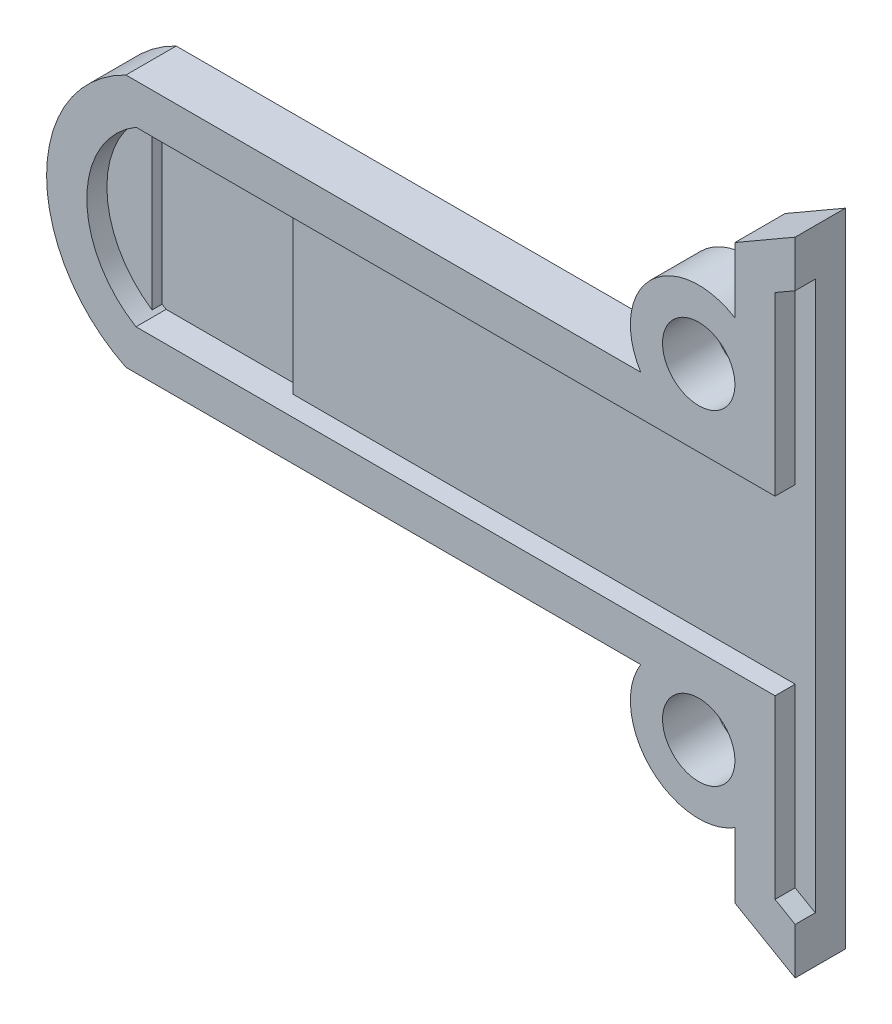
ISO-10303-21;
HEADER;
FILE_DESCRIPTION(('STEP AP214'),'2;1');
FILE_NAME('part.step','',(''),(''),'','','');
FILE_SCHEMA(('AUTOMOTIVE_DESIGN { 1 0 10303 214 1 1 1 1 }'));
ENDSEC;
DATA;
#1=APPLICATION_CONTEXT('core data for automotive mechanical design processes');
#2=APPLICATION_PROTOCOL_DEFINITION('international standard','automotive_design',2000,#1);
#3=PRODUCT_CONTEXT('',#1,'mechanical');
#4=PRODUCT('Part','Part','',(#3));
#5=PRODUCT_RELATED_PRODUCT_CATEGORY('part','',(#4));
#6=PRODUCT_DEFINITION_FORMATION('','',#4);
#7=PRODUCT_DEFINITION_CONTEXT('part definition',#1,'design');
#8=PRODUCT_DEFINITION('design','',#6,#7);
#9=PRODUCT_DEFINITION_SHAPE('','',#8);
#10=(LENGTH_UNIT() NAMED_UNIT(*) SI_UNIT(.MILLI.,.METRE.));
#11=(NAMED_UNIT(*) PLANE_ANGLE_UNIT() SI_UNIT($,.RADIAN.));
#12=(NAMED_UNIT(*) SI_UNIT($,.STERADIAN.) SOLID_ANGLE_UNIT());
#13=UNCERTAINTY_MEASURE_WITH_UNIT(LENGTH_MEASURE(1.E-05),#10,'distance_accuracy_value','');
#14=(GEOMETRIC_REPRESENTATION_CONTEXT(3) GLOBAL_UNCERTAINTY_ASSIGNED_CONTEXT((#13)) GLOBAL_UNIT_ASSIGNED_CONTEXT((#10,
#11,#12)) REPRESENTATION_CONTEXT('',''));
#15=CARTESIAN_POINT('',(0.,0.,0.));
#16=DIRECTION('',(0.,0.,1.));
#17=DIRECTION('',(1.,0.,0.));
#18=AXIS2_PLACEMENT_3D('',#15,#16,#17);
#19=CARTESIAN_POINT('',(30.25,31.4,-8.));
#20=DIRECTION('',(-1.,0.,0.));
#21=DIRECTION('',(0.,0.,1.));
#22=AXIS2_PLACEMENT_3D('',#19,#20,#21);
#23=PLANE('',#22);
#24=DIRECTION('',(0.,1.,0.));
#25=VECTOR('',#24,1.);
#26=CARTESIAN_POINT('',(30.25,0.,16.5));
#27=LINE('',#26,#25);
#28=CARTESIAN_POINT('',(30.25,-15.9637349430953,16.5));
#29=VERTEX_POINT('',#28);
#30=CARTESIAN_POINT('',(30.25,15.9637349430924,16.5));
#31=VERTEX_POINT('',#30);
#32=EDGE_CURVE('E11',#29,#31,#27,.T.);
#33=ORIENTED_EDGE('',*,*,#32,.T.);
#34=DIRECTION('',(0.,0.,-1.));
#35=VECTOR('',#34,1.);
#36=CARTESIAN_POINT('',(30.25,15.9637349430924,16.5));
#37=LINE('',#36,#35);
#38=CARTESIAN_POINT('',(30.25,15.9637349430924,19.));
#39=VERTEX_POINT('',#38);
#40=EDGE_CURVE('E364',#39,#31,#37,.T.);
#41=ORIENTED_EDGE('',*,*,#40,.F.);
#42=DIRECTION('',(0.,1.,0.));
#43=VECTOR('',#42,1.);
#44=CARTESIAN_POINT('',(30.25,0.,19.));
#45=LINE('',#44,#43);
#46=CARTESIAN_POINT('',(30.25,13.6543338663339,19.));
#47=VERTEX_POINT('',#46);
#48=EDGE_CURVE('E363',#47,#39,#45,.T.);
#49=ORIENTED_EDGE('',*,*,#48,.F.);
#50=DIRECTION('',(0.,0.,-1.));
#51=VECTOR('',#50,1.);
#52=CARTESIAN_POINT('',(30.25,13.6543338663339,16.5));
#53=LINE('',#52,#51);
#54=CARTESIAN_POINT('',(30.25,13.6543338663339,18.));
#55=VERTEX_POINT('',#54);
#56=EDGE_CURVE('E55',#47,#55,#53,.T.);
#57=ORIENTED_EDGE('',*,*,#56,.T.);
#58=DIRECTION('',(0.,1.,0.));
#59=VECTOR('',#58,1.);
#60=CARTESIAN_POINT('',(30.25,0.,18.));
#61=LINE('',#60,#59);
#62=CARTESIAN_POINT('',(30.25,-13.6543338663368,18.));
#63=VERTEX_POINT('',#62);
#64=EDGE_CURVE('E205',#63,#55,#61,.T.);
#65=ORIENTED_EDGE('',*,*,#64,.F.);
#66=DIRECTION('',(0.,0.,1.));
#67=VECTOR('',#66,1.);
#68=CARTESIAN_POINT('',(30.25,-13.6543338663368,16.5));
#69=LINE('',#68,#67);
#70=CARTESIAN_POINT('',(30.25,-13.6543338663368,19.));
#71=VERTEX_POINT('',#70);
#72=EDGE_CURVE('E40',#63,#71,#69,.T.);
#73=ORIENTED_EDGE('',*,*,#72,.T.);
#74=CARTESIAN_POINT('',(30.25,-15.9637349430953,19.));
#75=VERTEX_POINT('',#74);
#76=EDGE_CURVE('E47',#75,#71,#45,.T.);
#77=ORIENTED_EDGE('',*,*,#76,.F.);
#78=DIRECTION('',(0.,0.,1.));
#79=VECTOR('',#78,1.);
#80=CARTESIAN_POINT('',(30.25,-15.9637349430953,16.5));
#81=LINE('',#80,#79);
#82=EDGE_CURVE('E359',#29,#75,#81,.T.);
#83=ORIENTED_EDGE('',*,*,#82,.F.);
#84=EDGE_LOOP('',(#33,#41,#49,#57,#65,#73,#77,#83));
#85=FACE_BOUND('',#84,.T.);
#86=ADVANCED_FACE('F33',(#85),#23,.F.);
#87=CARTESIAN_POINT('',(0.,0.,18.));
#88=DIRECTION('',(0.,0.,-1.));
#89=DIRECTION('',(-1.,0.,0.));
#90=AXIS2_PLACEMENT_3D('',#87,#88,#89);
#91=PLANE('',#90);
#92=CARTESIAN_POINT('',(0.,0.,18.));
#93=DIRECTION('',(0.,0.,-1.));
#94=DIRECTION('',(-1.,0.,0.));
#95=AXIS2_PLACEMENT_3D('',#92,#93,#94);
#96=CIRCLE('',#95,5.);
#97=CARTESIAN_POINT('',(-2.75,-4.17582327212252,18.));
#98=VERTEX_POINT('',#97);
#99=CARTESIAN_POINT('',(-2.75,4.17582327212252,18.));
#100=VERTEX_POINT('',#99);
#101=EDGE_CURVE('E266',#98,#100,#96,.T.);
#102=ORIENTED_EDGE('',*,*,#101,.F.);
#103=DIRECTION('',(0.,1.,0.));
#104=VECTOR('',#103,1.);
#105=CARTESIAN_POINT('',(-2.75,-4.30000000000001,18.));
#106=LINE('',#105,#104);
#107=EDGE_CURVE('E248',#98,#100,#106,.T.);
#108=ORIENTED_EDGE('',*,*,#107,.T.);
#109=EDGE_LOOP('',(#102,#108));
#110=FACE_BOUND('',#109,.T.);
#111=ADVANCED_FACE('F400',(#110),#91,.F.);
#112=CARTESIAN_POINT('',(-2.75,-4.30000000000001,18.));
#113=DIRECTION('',(-1.,0.,0.));
#114=DIRECTION('',(0.,0.,1.));
#115=AXIS2_PLACEMENT_3D('',#112,#113,#114);
#116=PLANE('',#115);
#117=DIRECTION('',(0.,-1.,0.));
#118=VECTOR('',#117,1.);
#119=CARTESIAN_POINT('',(-2.75,-4.30000000000001,17.5));
#120=LINE('',#119,#118);
#121=CARTESIAN_POINT('',(-2.75,4.17582327212252,17.5));
#122=VERTEX_POINT('',#121);
#123=CARTESIAN_POINT('',(-2.75,-4.17582327212252,17.5));
#124=VERTEX_POINT('',#123);
#125=EDGE_CURVE('E347',#122,#124,#120,.T.);
#126=ORIENTED_EDGE('',*,*,#125,.F.);
#127=DIRECTION('',(0.,0.,1.));
#128=VECTOR('',#127,1.);
#129=CARTESIAN_POINT('',(-2.75,4.17582327212252,16.5));
#130=LINE('',#129,#128);
#131=EDGE_CURVE('E342',#100,#122,#130,.F.);
#132=ORIENTED_EDGE('',*,*,#131,.F.);
#133=ORIENTED_EDGE('',*,*,#107,.F.);
#134=DIRECTION('',(0.,0.,1.));
#135=VECTOR('',#134,1.);
#136=CARTESIAN_POINT('',(-2.75,-4.17582327212252,16.5));
#137=LINE('',#136,#135);
#138=EDGE_CURVE('E345',#124,#98,#137,.T.);
#139=ORIENTED_EDGE('',*,*,#138,.F.);
#140=EDGE_LOOP('',(#126,#132,#133,#139));
#141=FACE_BOUND('',#140,.T.);
#142=ADVANCED_FACE('F405',(#141),#116,.F.);
#143=CARTESIAN_POINT('',(0.,0.,17.5));
#144=DIRECTION('',(0.,0.,-1.));
#145=DIRECTION('',(-1.,0.,0.));
#146=AXIS2_PLACEMENT_3D('',#143,#144,#145);
#147=PLANE('',#146);
#148=DIRECTION('',(-1.,0.,0.));
#149=VECTOR('',#148,1.);
#150=CARTESIAN_POINT('',(-2.55147016443463,-4.29999999999999,17.5));
#151=LINE('',#150,#149);
#152=CARTESIAN_POINT('',(4.25,-4.30000000000001,17.5));
#153=VERTEX_POINT('',#152);
#154=CARTESIAN_POINT('',(-2.55147016443462,-4.29999999999999,17.5));
#155=VERTEX_POINT('',#154);
#156=EDGE_CURVE('E240',#153,#155,#151,.T.);
#157=ORIENTED_EDGE('',*,*,#156,.F.);
#158=DIRECTION('',(0.,1.,0.));
#159=VECTOR('',#158,1.);
#160=CARTESIAN_POINT('',(4.25,-4.30000000000001,17.5));
#161=LINE('',#160,#159);
#162=CARTESIAN_POINT('',(4.25,4.30000000000001,17.5));
#163=VERTEX_POINT('',#162);
#164=EDGE_CURVE('E244',#153,#163,#161,.T.);
#165=ORIENTED_EDGE('',*,*,#164,.T.);
#166=DIRECTION('',(1.,0.,0.));
#167=VECTOR('',#166,1.);
#168=CARTESIAN_POINT('',(29.25,4.30000000000001,17.5));
#169=LINE('',#168,#167);
#170=CARTESIAN_POINT('',(-2.5514701644346,4.30000000000001,17.5));
#171=VERTEX_POINT('',#170);
#172=EDGE_CURVE('E242',#171,#163,#169,.T.);
#173=ORIENTED_EDGE('',*,*,#172,.F.);
#174=CARTESIAN_POINT('',(0.,0.,17.5));
#175=DIRECTION('',(0.,0.,-1.));
#176=DIRECTION('',(-1.,0.,0.));
#177=AXIS2_PLACEMENT_3D('',#174,#175,#176);
#178=CIRCLE('',#177,5.);
#179=EDGE_CURVE('E239',#122,#171,#178,.T.);
#180=ORIENTED_EDGE('',*,*,#179,.F.);
#181=ORIENTED_EDGE('',*,*,#125,.T.);
#182=EDGE_CURVE('E236',#155,#124,#178,.T.);
#183=ORIENTED_EDGE('',*,*,#182,.F.);
#184=EDGE_LOOP('',(#157,#165,#173,#180,#181,#183));
#185=FACE_BOUND('',#184,.T.);
#186=ADVANCED_FACE('F431',(#185),#147,.F.);
#187=CARTESIAN_POINT('',(0.,0.,16.5));
#188=DIRECTION('',(0.,0.,1.));
#189=DIRECTION('',(1.,0.,0.));
#190=AXIS2_PLACEMENT_3D('',#187,#188,#189);
#191=CYLINDRICAL_SURFACE('',#190,5.);
#192=ORIENTED_EDGE('',*,*,#131,.T.);
#193=ORIENTED_EDGE('',*,*,#179,.T.);
#194=DIRECTION('',(0.,0.,1.));
#195=VECTOR('',#194,1.);
#196=CARTESIAN_POINT('',(-2.5514701644346,4.30000000000001,16.5));
#197=LINE('',#196,#195);
#198=CARTESIAN_POINT('',(-2.5514701644346,4.30000000000001,19.));
#199=VERTEX_POINT('',#198);
#200=EDGE_CURVE('E291',#171,#199,#197,.T.);
#201=ORIENTED_EDGE('',*,*,#200,.T.);
#202=CARTESIAN_POINT('',(0.,0.,19.));
#203=DIRECTION('',(0.,0.,-1.));
#204=DIRECTION('',(-1.,0.,0.));
#205=AXIS2_PLACEMENT_3D('',#202,#203,#204);
#206=CIRCLE('',#205,5.);
#207=CARTESIAN_POINT('',(-2.55147016443462,-4.29999999999999,19.));
#208=VERTEX_POINT('',#207);
#209=EDGE_CURVE('E283',#208,#199,#206,.T.);
#210=ORIENTED_EDGE('',*,*,#209,.F.);
#211=DIRECTION('',(0.,0.,1.));
#212=VECTOR('',#211,1.);
#213=CARTESIAN_POINT('',(-2.55147016443462,-4.29999999999999,16.5));
#214=LINE('',#213,#212);
#215=EDGE_CURVE('E293',#155,#208,#214,.T.);
#216=ORIENTED_EDGE('',*,*,#215,.F.);
#217=ORIENTED_EDGE('',*,*,#182,.T.);
#218=ORIENTED_EDGE('',*,*,#138,.T.);
#219=ORIENTED_EDGE('',*,*,#101,.T.);
#220=EDGE_LOOP('',(#192,#193,#201,#210,#216,#217,#218,#219));
#221=FACE_BOUND('',#220,.T.);
#222=ADVANCED_FACE('F427',(#221),#191,.F.);
#223=CARTESIAN_POINT('',(25.45,-8.09999999999999,28.616652224137));
#224=DIRECTION('',(0.,0.,-1.));
#225=DIRECTION('',(-1.,0.,0.));
#226=AXIS2_PLACEMENT_3D('',#223,#224,#225);
#227=CYLINDRICAL_SURFACE('',#226,1.8);
#228=CARTESIAN_POINT('',(25.45,-8.09999999999999,16.5));
#229=DIRECTION('',(0.,0.,-1.));
#230=DIRECTION('',(-1.,0.,0.));
#231=AXIS2_PLACEMENT_3D('',#228,#229,#230);
#232=CIRCLE('',#231,1.8);
#233=CARTESIAN_POINT('',(23.65,-8.09999999999999,16.5));
#234=VERTEX_POINT('',#233);
#235=EDGE_CURVE('E216',#234,#234,#232,.T.);
#236=ORIENTED_EDGE('',*,*,#235,.T.);
#237=EDGE_LOOP('',(#236));
#238=FACE_BOUND('',#237,.T.);
#239=CARTESIAN_POINT('',(25.45,-8.09999999999999,19.));
#240=DIRECTION('',(0.,0.,-1.));
#241=DIRECTION('',(-1.,0.,0.));
#242=AXIS2_PLACEMENT_3D('',#239,#240,#241);
#243=CIRCLE('',#242,1.8);
#244=CARTESIAN_POINT('',(23.65,-8.09999999999999,19.));
#245=VERTEX_POINT('',#244);
#246=EDGE_CURVE('E211',#245,#245,#243,.F.);
#247=ORIENTED_EDGE('',*,*,#246,.T.);
#248=EDGE_LOOP('',(#247));
#249=FACE_BOUND('',#248,.T.);
#250=ADVANCED_FACE('F430',(#238,#249),#227,.F.);
#251=CARTESIAN_POINT('',(25.45,8.10000000000001,28.616652224137));
#252=DIRECTION('',(0.,0.,-1.));
#253=DIRECTION('',(-1.,0.,0.));
#254=AXIS2_PLACEMENT_3D('',#251,#252,#253);
#255=CYLINDRICAL_SURFACE('',#254,1.8);
#256=CARTESIAN_POINT('',(25.45,8.10000000000001,16.5));
#257=DIRECTION('',(0.,0.,-1.));
#258=DIRECTION('',(-1.,0.,0.));
#259=AXIS2_PLACEMENT_3D('',#256,#257,#258);
#260=CIRCLE('',#259,1.8);
#261=CARTESIAN_POINT('',(23.65,8.10000000000001,16.5));
#262=VERTEX_POINT('',#261);
#263=EDGE_CURVE('E222',#262,#262,#260,.T.);
#264=ORIENTED_EDGE('',*,*,#263,.T.);
#265=EDGE_LOOP('',(#264));
#266=FACE_BOUND('',#265,.T.);
#267=CARTESIAN_POINT('',(25.45,8.10000000000001,19.));
#268=DIRECTION('',(0.,0.,-1.));
#269=DIRECTION('',(-1.,0.,0.));
#270=AXIS2_PLACEMENT_3D('',#267,#268,#269);
#271=CIRCLE('',#270,1.8);
#272=CARTESIAN_POINT('',(23.65,8.10000000000001,19.));
#273=VERTEX_POINT('',#272);
#274=EDGE_CURVE('E226',#273,#273,#271,.F.);
#275=ORIENTED_EDGE('',*,*,#274,.T.);
#276=EDGE_LOOP('',(#275));
#277=FACE_BOUND('',#276,.T.);
#278=ADVANCED_FACE('F469',(#266,#277),#255,.F.);
#279=CARTESIAN_POINT('',(25.45,8.10000000000001,28.616652224137));
#280=DIRECTION('',(0.,0.,-1.));
#281=DIRECTION('',(-1.,0.,0.));
#282=AXIS2_PLACEMENT_3D('',#279,#280,#281);
#283=CYLINDRICAL_SURFACE('',#282,3.4);
#284=DIRECTION('',(0.,0.,-1.));
#285=VECTOR('',#284,1.);
#286=CARTESIAN_POINT('',(22.5655589796288,6.30000000000001,28.616652224137));
#287=LINE('',#286,#285);
#288=CARTESIAN_POINT('',(22.5655589796288,6.30000000000001,19.));
#289=VERTEX_POINT('',#288);
#290=CARTESIAN_POINT('',(22.5655589796288,6.30000000000001,16.5));
#291=VERTEX_POINT('',#290);
#292=EDGE_CURVE('E234',#289,#291,#287,.T.);
#293=ORIENTED_EDGE('',*,*,#292,.F.);
#294=CARTESIAN_POINT('',(25.45,8.10000000000001,19.));
#295=DIRECTION('',(0.,0.,-1.));
#296=DIRECTION('',(-1.,0.,0.));
#297=AXIS2_PLACEMENT_3D('',#294,#295,#296);
#298=CIRCLE('',#297,3.4);
#299=CARTESIAN_POINT('',(27.25,10.9844410203712,19.));
#300=VERTEX_POINT('',#299);
#301=EDGE_CURVE('E223',#300,#289,#298,.F.);
#302=ORIENTED_EDGE('',*,*,#301,.F.);
#303=DIRECTION('',(0.,0.,-1.));
#304=VECTOR('',#303,1.);
#305=CARTESIAN_POINT('',(27.25,10.9844410203712,28.616652224137));
#306=LINE('',#305,#304);
#307=CARTESIAN_POINT('',(27.25,10.9844410203712,16.5));
#308=VERTEX_POINT('',#307);
#309=EDGE_CURVE('E206',#308,#300,#306,.F.);
#310=ORIENTED_EDGE('',*,*,#309,.F.);
#311=CARTESIAN_POINT('',(25.45,8.10000000000001,16.5));
#312=DIRECTION('',(0.,0.,-1.));
#313=DIRECTION('',(-1.,0.,0.));
#314=AXIS2_PLACEMENT_3D('',#311,#312,#313);
#315=CIRCLE('',#314,3.4);
#316=EDGE_CURVE('E227',#291,#308,#315,.T.);
#317=ORIENTED_EDGE('',*,*,#316,.F.);
#318=EDGE_LOOP('',(#293,#302,#310,#317));
#319=FACE_BOUND('',#318,.T.);
#320=ADVANCED_FACE('F379',(#319),#283,.T.);
#321=CARTESIAN_POINT('',(27.25,6.30000000000001,16.5));
#322=DIRECTION('',(0.,-1.,0.));
#323=DIRECTION('',(1.,0.,0.));
#324=AXIS2_PLACEMENT_3D('',#321,#322,#323);
#325=PLANE('',#324);
#326=DIRECTION('',(1.,0.,0.));
#327=VECTOR('',#326,1.);
#328=CARTESIAN_POINT('',(27.25,6.30000000000001,19.));
#329=LINE('',#328,#327);
#330=CARTESIAN_POINT('',(-3.05122926047846,6.30000000000001,19.));
#331=VERTEX_POINT('',#330);
#332=EDGE_CURVE('E320',#331,#289,#329,.T.);
#333=ORIENTED_EDGE('',*,*,#332,.T.);
#334=ORIENTED_EDGE('',*,*,#292,.T.);
#335=DIRECTION('',(1.,0.,0.));
#336=VECTOR('',#335,1.);
#337=CARTESIAN_POINT('',(18.9818334204049,6.30000000000001,16.5));
#338=LINE('',#337,#336);
#339=CARTESIAN_POINT('',(-3.05122926047846,6.30000000000001,16.5));
#340=VERTEX_POINT('',#339);
#341=EDGE_CURVE('E305',#340,#291,#338,.T.);
#342=ORIENTED_EDGE('',*,*,#341,.F.);
#343=DIRECTION('',(0.,0.,1.));
#344=VECTOR('',#343,1.);
#345=CARTESIAN_POINT('',(-3.05122926047846,6.30000000000001,16.5));
#346=LINE('',#345,#344);
#347=EDGE_CURVE('E335',#340,#331,#346,.T.);
#348=ORIENTED_EDGE('',*,*,#347,.T.);
#349=EDGE_LOOP('',(#333,#334,#342,#348));
#350=FACE_BOUND('',#349,.T.);
#351=ADVANCED_FACE('F383',(#350),#325,.F.);
#352=CARTESIAN_POINT('',(0.,0.,16.5));
#353=DIRECTION('',(0.,0.,1.));
#354=DIRECTION('',(1.,0.,0.));
#355=AXIS2_PLACEMENT_3D('',#352,#353,#354);
#356=CYLINDRICAL_SURFACE('',#355,7.);
#357=DIRECTION('',(0.,0.,1.));
#358=VECTOR('',#357,1.);
#359=CARTESIAN_POINT('',(-3.05122926047848,-6.29999999999999,16.5));
#360=LINE('',#359,#358);
#361=CARTESIAN_POINT('',(-3.05122926047848,-6.29999999999999,16.5));
#362=VERTEX_POINT('',#361);
#363=CARTESIAN_POINT('',(-3.05122926047848,-6.29999999999999,19.));
#364=VERTEX_POINT('',#363);
#365=EDGE_CURVE('E337',#362,#364,#360,.T.);
#366=ORIENTED_EDGE('',*,*,#365,.T.);
#367=CARTESIAN_POINT('',(0.,0.,19.));
#368=DIRECTION('',(0.,0.,-1.));
#369=DIRECTION('',(-1.,0.,0.));
#370=AXIS2_PLACEMENT_3D('',#367,#368,#369);
#371=CIRCLE('',#370,7.);
#372=EDGE_CURVE('E192',#364,#331,#371,.T.);
#373=ORIENTED_EDGE('',*,*,#372,.T.);
#374=ORIENTED_EDGE('',*,*,#347,.F.);
#375=CARTESIAN_POINT('',(0.,0.,16.5));
#376=DIRECTION('',(0.,0.,-1.));
#377=DIRECTION('',(-1.,0.,0.));
#378=AXIS2_PLACEMENT_3D('',#375,#376,#377);
#379=CIRCLE('',#378,7.);
#380=EDGE_CURVE('E303',#362,#340,#379,.T.);
#381=ORIENTED_EDGE('',*,*,#380,.F.);
#382=EDGE_LOOP('',(#366,#373,#374,#381));
#383=FACE_BOUND('',#382,.T.);
#384=ADVANCED_FACE('F390',(#383),#356,.T.);
#385=CARTESIAN_POINT('',(20.6608325098482,-6.29999999999999,16.5));
#386=DIRECTION('',(0.,1.,0.));
#387=DIRECTION('',(-1.,0.,0.));
#388=AXIS2_PLACEMENT_3D('',#385,#386,#387);
#389=PLANE('',#388);
#390=DIRECTION('',(-1.,0.,0.));
#391=VECTOR('',#390,1.);
#392=CARTESIAN_POINT('',(18.9818334204049,-6.29999999999999,16.5));
#393=LINE('',#392,#391);
#394=CARTESIAN_POINT('',(22.5655589796288,-6.29999999999999,16.5));
#395=VERTEX_POINT('',#394);
#396=EDGE_CURVE('E196',#395,#362,#393,.T.);
#397=ORIENTED_EDGE('',*,*,#396,.F.);
#398=DIRECTION('',(0.,0.,-1.));
#399=VECTOR('',#398,1.);
#400=CARTESIAN_POINT('',(22.5655589796288,-6.29999999999999,28.616652224137));
#401=LINE('',#400,#399);
#402=CARTESIAN_POINT('',(22.5655589796288,-6.29999999999999,19.));
#403=VERTEX_POINT('',#402);
#404=EDGE_CURVE('E200',#395,#403,#401,.F.);
#405=ORIENTED_EDGE('',*,*,#404,.T.);
#406=DIRECTION('',(-1.,0.,0.));
#407=VECTOR('',#406,1.);
#408=CARTESIAN_POINT('',(20.6608325098482,-6.29999999999999,19.));
#409=LINE('',#408,#407);
#410=EDGE_CURVE('E183',#403,#364,#409,.T.);
#411=ORIENTED_EDGE('',*,*,#410,.T.);
#412=ORIENTED_EDGE('',*,*,#365,.F.);
#413=EDGE_LOOP('',(#397,#405,#411,#412));
#414=FACE_BOUND('',#413,.T.);
#415=ADVANCED_FACE('F201',(#414),#389,.F.);
#416=CARTESIAN_POINT('',(25.45,-8.09999999999999,28.616652224137));
#417=DIRECTION('',(0.,0.,-1.));
#418=DIRECTION('',(-1.,0.,0.));
#419=AXIS2_PLACEMENT_3D('',#416,#417,#418);
#420=CYLINDRICAL_SURFACE('',#419,3.4);
#421=DIRECTION('',(0.,0.,-1.));
#422=VECTOR('',#421,1.);
#423=CARTESIAN_POINT('',(27.25,-10.9844410203712,28.616652224137));
#424=LINE('',#423,#422);
#425=CARTESIAN_POINT('',(27.25,-10.9844410203712,19.));
#426=VERTEX_POINT('',#425);
#427=CARTESIAN_POINT('',(27.25,-10.9844410203712,16.5));
#428=VERTEX_POINT('',#427);
#429=EDGE_CURVE('E210',#426,#428,#424,.T.);
#430=ORIENTED_EDGE('',*,*,#429,.F.);
#431=CARTESIAN_POINT('',(25.45,-8.09999999999999,19.));
#432=DIRECTION('',(0.,0.,-1.));
#433=DIRECTION('',(-1.,0.,0.));
#434=AXIS2_PLACEMENT_3D('',#431,#432,#433);
#435=CIRCLE('',#434,3.4);
#436=EDGE_CURVE('E189',#403,#426,#435,.F.);
#437=ORIENTED_EDGE('',*,*,#436,.F.);
#438=ORIENTED_EDGE('',*,*,#404,.F.);
#439=CARTESIAN_POINT('',(25.45,-8.09999999999999,16.5));
#440=DIRECTION('',(0.,0.,-1.));
#441=DIRECTION('',(-1.,0.,0.));
#442=AXIS2_PLACEMENT_3D('',#439,#440,#441);
#443=CIRCLE('',#442,3.4);
#444=EDGE_CURVE('E212',#428,#395,#443,.T.);
#445=ORIENTED_EDGE('',*,*,#444,.F.);
#446=EDGE_LOOP('',(#430,#437,#438,#445));
#447=FACE_BOUND('',#446,.T.);
#448=ADVANCED_FACE('F209',(#447),#420,.T.);
#449=CARTESIAN_POINT('',(27.25,6.30000000000001,16.5));
#450=DIRECTION('',(1.,0.,0.));
#451=DIRECTION('',(0.,0.,-1.));
#452=AXIS2_PLACEMENT_3D('',#449,#450,#451);
#453=PLANE('',#452);
#454=DIRECTION('',(0.,1.,0.));
#455=VECTOR('',#454,1.);
#456=CARTESIAN_POINT('',(27.25,6.30000000000001,16.5));
#457=LINE('',#456,#455);
#458=CARTESIAN_POINT('',(27.25,14.2316841355235,16.5));
#459=VERTEX_POINT('',#458);
#460=EDGE_CURVE('E308',#308,#459,#457,.T.);
#461=ORIENTED_EDGE('',*,*,#460,.F.);
#462=ORIENTED_EDGE('',*,*,#309,.T.);
#463=DIRECTION('',(0.,1.,0.));
#464=VECTOR('',#463,1.);
#465=CARTESIAN_POINT('',(27.25,6.30000000000001,19.));
#466=LINE('',#465,#464);
#467=CARTESIAN_POINT('',(27.25,14.2316841355235,19.));
#468=VERTEX_POINT('',#467);
#469=EDGE_CURVE('E322',#300,#468,#466,.T.);
#470=ORIENTED_EDGE('',*,*,#469,.T.);
#471=DIRECTION('',(0.,0.,1.));
#472=VECTOR('',#471,1.);
#473=CARTESIAN_POINT('',(27.25,14.2316841355235,16.5));
#474=LINE('',#473,#472);
#475=EDGE_CURVE('E332',#459,#468,#474,.T.);
#476=ORIENTED_EDGE('',*,*,#475,.F.);
#477=EDGE_LOOP('',(#461,#462,#470,#476));
#478=FACE_BOUND('',#477,.T.);
#479=ADVANCED_FACE('F374',(#478),#453,.F.);
#480=CARTESIAN_POINT('',(27.25,-14.2316841355264,16.5));
#481=DIRECTION('',(1.,0.,0.));
#482=DIRECTION('',(0.,0.,-1.));
#483=AXIS2_PLACEMENT_3D('',#480,#481,#482);
#484=PLANE('',#483);
#485=DIRECTION('',(0.,1.,0.));
#486=VECTOR('',#485,1.);
#487=CARTESIAN_POINT('',(27.25,-14.2316841355264,19.));
#488=LINE('',#487,#486);
#489=CARTESIAN_POINT('',(27.25,-14.2316841355264,19.));
#490=VERTEX_POINT('',#489);
#491=EDGE_CURVE('E197',#490,#426,#488,.T.);
#492=ORIENTED_EDGE('',*,*,#491,.T.);
#493=ORIENTED_EDGE('',*,*,#429,.T.);
#494=DIRECTION('',(0.,1.,0.));
#495=VECTOR('',#494,1.);
#496=CARTESIAN_POINT('',(27.25,-14.2316841355264,16.5));
#497=LINE('',#496,#495);
#498=CARTESIAN_POINT('',(27.25,-14.2316841355264,16.5));
#499=VERTEX_POINT('',#498);
#500=EDGE_CURVE('E315',#499,#428,#497,.T.);
#501=ORIENTED_EDGE('',*,*,#500,.F.);
#502=DIRECTION('',(0.,0.,1.));
#503=VECTOR('',#502,1.);
#504=CARTESIAN_POINT('',(27.25,-14.2316841355264,16.5));
#505=LINE('',#504,#503);
#506=EDGE_CURVE('E318',#499,#490,#505,.T.);
#507=ORIENTED_EDGE('',*,*,#506,.T.);
#508=EDGE_LOOP('',(#492,#493,#501,#507));
#509=FACE_BOUND('',#508,.T.);
#510=ADVANCED_FACE('F450',(#509),#484,.F.);
#511=CARTESIAN_POINT('',(0.,0.,19.));
#512=DIRECTION('',(0.,0.,-1.));
#513=DIRECTION('',(-1.,0.,0.));
#514=AXIS2_PLACEMENT_3D('',#511,#512,#513);
#515=PLANE('',#514);
#516=DIRECTION('',(-0.866025403784439,0.5,0.));
#517=VECTOR('',#516,1.);
#518=CARTESIAN_POINT('',(30.832428163369,-16.3,19.));
#519=LINE('',#518,#517);
#520=EDGE_CURVE('E327',#75,#490,#519,.T.);
#521=ORIENTED_EDGE('',*,*,#520,.F.);
#522=ORIENTED_EDGE('',*,*,#76,.T.);
#523=DIRECTION('',(-0.866025403784439,0.5,0.));
#524=VECTOR('',#523,1.);
#525=CARTESIAN_POINT('',(31.3683265482312,-14.3,19.));
#526=LINE('',#525,#524);
#527=CARTESIAN_POINT('',(29.25,-13.0769835971472,19.));
#528=VERTEX_POINT('',#527);
#529=EDGE_CURVE('E275',#71,#528,#526,.T.);
#530=ORIENTED_EDGE('',*,*,#529,.T.);
#531=DIRECTION('',(0.,1.,0.));
#532=VECTOR('',#531,1.);
#533=CARTESIAN_POINT('',(29.25,-13.0769835971472,19.));
#534=LINE('',#533,#532);
#535=CARTESIAN_POINT('',(29.25,-4.29999999999999,19.));
#536=VERTEX_POINT('',#535);
#537=EDGE_CURVE('E277',#528,#536,#534,.T.);
#538=ORIENTED_EDGE('',*,*,#537,.T.);
#539=DIRECTION('',(-1.,0.,0.));
#540=VECTOR('',#539,1.);
#541=CARTESIAN_POINT('',(-2.55147016443463,-4.29999999999999,19.));
#542=LINE('',#541,#540);
#543=EDGE_CURVE('E280',#536,#208,#542,.T.);
#544=ORIENTED_EDGE('',*,*,#543,.T.);
#545=ORIENTED_EDGE('',*,*,#209,.T.);
#546=DIRECTION('',(1.,0.,0.));
#547=VECTOR('',#546,1.);
#548=CARTESIAN_POINT('',(29.25,4.30000000000001,19.));
#549=LINE('',#548,#547);
#550=CARTESIAN_POINT('',(29.25,4.30000000000001,19.));
#551=VERTEX_POINT('',#550);
#552=EDGE_CURVE('E286',#199,#551,#549,.T.);
#553=ORIENTED_EDGE('',*,*,#552,.T.);
#554=DIRECTION('',(0.,1.,0.));
#555=VECTOR('',#554,1.);
#556=CARTESIAN_POINT('',(29.25,4.30000000000001,19.));
#557=LINE('',#556,#555);
#558=CARTESIAN_POINT('',(29.25,13.0769835971443,19.));
#559=VERTEX_POINT('',#558);
#560=EDGE_CURVE('E269',#551,#559,#557,.T.);
#561=ORIENTED_EDGE('',*,*,#560,.T.);
#562=DIRECTION('',(0.866025403784439,0.5,0.));
#563=VECTOR('',#562,1.);
#564=CARTESIAN_POINT('',(29.25,13.0769835971443,19.));
#565=LINE('',#564,#563);
#566=EDGE_CURVE('E272',#559,#47,#565,.T.);
#567=ORIENTED_EDGE('',*,*,#566,.T.);
#568=ORIENTED_EDGE('',*,*,#48,.T.);
#569=DIRECTION('',(0.866025403784439,0.5,0.));
#570=VECTOR('',#569,1.);
#571=CARTESIAN_POINT('',(27.25,14.2316841355235,19.));
#572=LINE('',#571,#570);
#573=EDGE_CURVE('E324',#468,#39,#572,.T.);
#574=ORIENTED_EDGE('',*,*,#573,.F.);
#575=ORIENTED_EDGE('',*,*,#469,.F.);
#576=ORIENTED_EDGE('',*,*,#301,.T.);
#577=ORIENTED_EDGE('',*,*,#332,.F.);
#578=ORIENTED_EDGE('',*,*,#372,.F.);
#579=ORIENTED_EDGE('',*,*,#410,.F.);
#580=ORIENTED_EDGE('',*,*,#436,.T.);
#581=ORIENTED_EDGE('',*,*,#491,.F.);
#582=EDGE_LOOP('',(#521,#522,#530,#538,#544,#545,#553,#561,#567,#568,#574,#575,#576,#577,#578,
#579,#580,#581));
#583=FACE_BOUND('',#582,.T.);
#584=ORIENTED_EDGE('',*,*,#274,.F.);
#585=EDGE_LOOP('',(#584));
#586=FACE_BOUND('',#585,.T.);
#587=ORIENTED_EDGE('',*,*,#246,.F.);
#588=EDGE_LOOP('',(#587));
#589=FACE_BOUND('',#588,.T.);
#590=ADVANCED_FACE('F185',(#583,#586,#589),#515,.F.);
#591=CARTESIAN_POINT('',(0.,0.,16.5));
#592=DIRECTION('',(0.,0.,-1.));
#593=DIRECTION('',(-1.,0.,0.));
#594=AXIS2_PLACEMENT_3D('',#591,#592,#593);
#595=PLANE('',#594);
#596=ORIENTED_EDGE('',*,*,#32,.F.);
#597=DIRECTION('',(-0.866025403784439,0.5,0.));
#598=VECTOR('',#597,1.);
#599=CARTESIAN_POINT('',(30.832428163369,-16.3,16.5));
#600=LINE('',#599,#598);
#601=EDGE_CURVE('E313',#29,#499,#600,.T.);
#602=ORIENTED_EDGE('',*,*,#601,.T.);
#603=ORIENTED_EDGE('',*,*,#500,.T.);
#604=ORIENTED_EDGE('',*,*,#444,.T.);
#605=ORIENTED_EDGE('',*,*,#396,.T.);
#606=ORIENTED_EDGE('',*,*,#380,.T.);
#607=ORIENTED_EDGE('',*,*,#341,.T.);
#608=ORIENTED_EDGE('',*,*,#316,.T.);
#609=ORIENTED_EDGE('',*,*,#460,.T.);
#610=DIRECTION('',(0.866025403784439,0.5,0.));
#611=VECTOR('',#610,1.);
#612=CARTESIAN_POINT('',(27.25,14.2316841355235,16.5));
#613=LINE('',#612,#611);
#614=EDGE_CURVE('E310',#459,#31,#613,.T.);
#615=ORIENTED_EDGE('',*,*,#614,.T.);
#616=EDGE_LOOP('',(#596,#602,#603,#604,#605,#606,#607,#608,#609,#615));
#617=FACE_BOUND('',#616,.T.);
#618=ORIENTED_EDGE('',*,*,#263,.F.);
#619=EDGE_LOOP('',(#618));
#620=FACE_BOUND('',#619,.T.);
#621=ORIENTED_EDGE('',*,*,#235,.F.);
#622=EDGE_LOOP('',(#621));
#623=FACE_BOUND('',#622,.T.);
#624=ADVANCED_FACE('F385',(#617,#620,#623),#595,.T.);
#625=CARTESIAN_POINT('',(30.832428163369,-16.3,16.5));
#626=DIRECTION('',(0.5,0.866025403784439,0.));
#627=DIRECTION('',(-0.866025403784439,0.5,0.));
#628=AXIS2_PLACEMENT_3D('',#625,#626,#627);
#629=PLANE('',#628);
#630=ORIENTED_EDGE('',*,*,#601,.F.);
#631=ORIENTED_EDGE('',*,*,#82,.T.);
#632=ORIENTED_EDGE('',*,*,#520,.T.);
#633=ORIENTED_EDGE('',*,*,#506,.F.);
#634=EDGE_LOOP('',(#630,#631,#632,#633));
#635=FACE_BOUND('',#634,.T.);
#636=ADVANCED_FACE('F448',(#635),#629,.F.);
#637=CARTESIAN_POINT('',(27.25,14.2316841355235,16.5));
#638=DIRECTION('',(0.5,-0.866025403784439,0.));
#639=DIRECTION('',(0.866025403784439,0.5,0.));
#640=AXIS2_PLACEMENT_3D('',#637,#638,#639);
#641=PLANE('',#640);
#642=ORIENTED_EDGE('',*,*,#573,.T.);
#643=ORIENTED_EDGE('',*,*,#40,.T.);
#644=ORIENTED_EDGE('',*,*,#614,.F.);
#645=ORIENTED_EDGE('',*,*,#475,.T.);
#646=EDGE_LOOP('',(#642,#643,#644,#645));
#647=FACE_BOUND('',#646,.T.);
#648=ADVANCED_FACE('F371',(#647),#641,.F.);
#649=CARTESIAN_POINT('',(29.25,-13.0769835971472,16.5));
#650=DIRECTION('',(1.,0.,0.));
#651=DIRECTION('',(0.,0.,-1.));
#652=AXIS2_PLACEMENT_3D('',#649,#650,#651);
#653=PLANE('',#652);
#654=DIRECTION('',(0.,0.,1.));
#655=VECTOR('',#654,1.);
#656=CARTESIAN_POINT('',(29.25,-13.0769835971472,16.5));
#657=LINE('',#656,#655);
#658=CARTESIAN_POINT('',(29.25,-13.0769835971472,18.));
#659=VERTEX_POINT('',#658);
#660=EDGE_CURVE('E297',#659,#528,#657,.T.);
#661=ORIENTED_EDGE('',*,*,#660,.F.);
#662=DIRECTION('',(0.,1.,0.));
#663=VECTOR('',#662,1.);
#664=CARTESIAN_POINT('',(29.25,-13.0769835971472,18.));
#665=LINE('',#664,#663);
#666=CARTESIAN_POINT('',(29.25,-4.29999999999999,18.));
#667=VERTEX_POINT('',#666);
#668=EDGE_CURVE('E260',#659,#667,#665,.T.);
#669=ORIENTED_EDGE('',*,*,#668,.T.);
#670=DIRECTION('',(0.,0.,1.));
#671=VECTOR('',#670,1.);
#672=CARTESIAN_POINT('',(29.25,-4.29999999999999,16.5));
#673=LINE('',#672,#671);
#674=EDGE_CURVE('E295',#667,#536,#673,.T.);
#675=ORIENTED_EDGE('',*,*,#674,.T.);
#676=ORIENTED_EDGE('',*,*,#537,.F.);
#677=EDGE_LOOP('',(#661,#669,#675,#676));
#678=FACE_BOUND('',#677,.T.);
#679=ADVANCED_FACE('F436',(#678),#653,.T.);
#680=CARTESIAN_POINT('',(-2.55147016443463,-4.29999999999999,16.5));
#681=DIRECTION('',(0.,1.,0.));
#682=DIRECTION('',(0.,0.,1.));
#683=AXIS2_PLACEMENT_3D('',#680,#681,#682);
#684=PLANE('',#683);
#685=DIRECTION('',(0.,0.,-1.));
#686=VECTOR('',#685,1.);
#687=CARTESIAN_POINT('',(4.25,-4.30000000000001,18.));
#688=LINE('',#687,#686);
#689=CARTESIAN_POINT('',(4.25,-4.30000000000001,18.));
#690=VERTEX_POINT('',#689);
#691=EDGE_CURVE('E251',#690,#153,#688,.T.);
#692=ORIENTED_EDGE('',*,*,#691,.T.);
#693=ORIENTED_EDGE('',*,*,#156,.T.);
#694=ORIENTED_EDGE('',*,*,#215,.T.);
#695=ORIENTED_EDGE('',*,*,#543,.F.);
#696=ORIENTED_EDGE('',*,*,#674,.F.);
#697=DIRECTION('',(-1.,0.,0.));
#698=VECTOR('',#697,1.);
#699=CARTESIAN_POINT('',(-2.55147016443463,-4.29999999999999,18.));
#700=LINE('',#699,#698);
#701=EDGE_CURVE('E263',#667,#690,#700,.T.);
#702=ORIENTED_EDGE('',*,*,#701,.T.);
#703=EDGE_LOOP('',(#692,#693,#694,#695,#696,#702));
#704=FACE_BOUND('',#703,.T.);
#705=ADVANCED_FACE('F433',(#704),#684,.T.);
#706=CARTESIAN_POINT('',(4.25,-4.30000000000001,18.));
#707=DIRECTION('',(1.,0.,0.));
#708=DIRECTION('',(0.,0.,-1.));
#709=AXIS2_PLACEMENT_3D('',#706,#707,#708);
#710=PLANE('',#709);
#711=ORIENTED_EDGE('',*,*,#164,.F.);
#712=ORIENTED_EDGE('',*,*,#691,.F.);
#713=DIRECTION('',(0.,-1.,0.));
#714=VECTOR('',#713,1.);
#715=CARTESIAN_POINT('',(4.25,-4.30000000000001,18.));
#716=LINE('',#715,#714);
#717=CARTESIAN_POINT('',(4.25,4.30000000000001,18.));
#718=VERTEX_POINT('',#717);
#719=EDGE_CURVE('E247',#718,#690,#716,.T.);
#720=ORIENTED_EDGE('',*,*,#719,.F.);
#721=DIRECTION('',(0.,0.,-1.));
#722=VECTOR('',#721,1.);
#723=CARTESIAN_POINT('',(4.25,4.30000000000001,18.));
#724=LINE('',#723,#722);
#725=EDGE_CURVE('E256',#718,#163,#724,.T.);
#726=ORIENTED_EDGE('',*,*,#725,.T.);
#727=EDGE_LOOP('',(#711,#712,#720,#726));
#728=FACE_BOUND('',#727,.T.);
#729=ADVANCED_FACE('F425',(#728),#710,.F.);
#730=CARTESIAN_POINT('',(29.25,4.30000000000001,16.5));
#731=DIRECTION('',(0.,-1.,0.));
#732=DIRECTION('',(0.,0.,-1.));
#733=AXIS2_PLACEMENT_3D('',#730,#731,#732);
#734=PLANE('',#733);
#735=ORIENTED_EDGE('',*,*,#200,.F.);
#736=ORIENTED_EDGE('',*,*,#172,.T.);
#737=ORIENTED_EDGE('',*,*,#725,.F.);
#738=DIRECTION('',(1.,0.,0.));
#739=VECTOR('',#738,1.);
#740=CARTESIAN_POINT('',(29.25,4.30000000000001,18.));
#741=LINE('',#740,#739);
#742=CARTESIAN_POINT('',(29.25,4.30000000000001,18.));
#743=VERTEX_POINT('',#742);
#744=EDGE_CURVE('E339',#718,#743,#741,.T.);
#745=ORIENTED_EDGE('',*,*,#744,.T.);
#746=DIRECTION('',(0.,0.,1.));
#747=VECTOR('',#746,1.);
#748=CARTESIAN_POINT('',(29.25,4.30000000000001,16.5));
#749=LINE('',#748,#747);
#750=EDGE_CURVE('E289',#743,#551,#749,.T.);
#751=ORIENTED_EDGE('',*,*,#750,.T.);
#752=ORIENTED_EDGE('',*,*,#552,.F.);
#753=EDGE_LOOP('',(#735,#736,#737,#745,#751,#752));
#754=FACE_BOUND('',#753,.T.);
#755=ADVANCED_FACE('F421',(#754),#734,.T.);
#756=CARTESIAN_POINT('',(29.25,4.30000000000001,16.5));
#757=DIRECTION('',(1.,0.,0.));
#758=DIRECTION('',(0.,0.,-1.));
#759=AXIS2_PLACEMENT_3D('',#756,#757,#758);
#760=PLANE('',#759);
#761=ORIENTED_EDGE('',*,*,#750,.F.);
#762=DIRECTION('',(0.,1.,0.));
#763=VECTOR('',#762,1.);
#764=CARTESIAN_POINT('',(29.25,4.30000000000001,18.));
#765=LINE('',#764,#763);
#766=CARTESIAN_POINT('',(29.25,13.0769835971443,18.));
#767=VERTEX_POINT('',#766);
#768=EDGE_CURVE('E252',#743,#767,#765,.T.);
#769=ORIENTED_EDGE('',*,*,#768,.T.);
#770=DIRECTION('',(0.,0.,1.));
#771=VECTOR('',#770,1.);
#772=CARTESIAN_POINT('',(29.25,13.0769835971443,16.5));
#773=LINE('',#772,#771);
#774=EDGE_CURVE('E300',#767,#559,#773,.T.);
#775=ORIENTED_EDGE('',*,*,#774,.T.);
#776=ORIENTED_EDGE('',*,*,#560,.F.);
#777=EDGE_LOOP('',(#761,#769,#775,#776));
#778=FACE_BOUND('',#777,.T.);
#779=ADVANCED_FACE('F424',(#778),#760,.T.);
#780=CARTESIAN_POINT('',(29.25,13.0769835971443,16.5));
#781=DIRECTION('',(0.5,-0.866025403784439,0.));
#782=DIRECTION('',(0.866025403784439,0.5,0.));
#783=AXIS2_PLACEMENT_3D('',#780,#781,#782);
#784=PLANE('',#783);
#785=ORIENTED_EDGE('',*,*,#56,.F.);
#786=ORIENTED_EDGE('',*,*,#566,.F.);
#787=ORIENTED_EDGE('',*,*,#774,.F.);
#788=DIRECTION('',(0.866025403784439,0.5,0.));
#789=VECTOR('',#788,1.);
#790=CARTESIAN_POINT('',(29.25,13.0769835971443,18.));
#791=LINE('',#790,#789);
#792=EDGE_CURVE('E255',#767,#55,#791,.T.);
#793=ORIENTED_EDGE('',*,*,#792,.T.);
#794=EDGE_LOOP('',(#785,#786,#787,#793));
#795=FACE_BOUND('',#794,.T.);
#796=ADVANCED_FACE('F414',(#795),#784,.T.);
#797=CARTESIAN_POINT('',(31.3683265482312,-14.3,16.5));
#798=DIRECTION('',(0.5,0.866025403784438,0.));
#799=DIRECTION('',(-0.866025403784439,0.5,0.));
#800=AXIS2_PLACEMENT_3D('',#797,#798,#799);
#801=PLANE('',#800);
#802=ORIENTED_EDGE('',*,*,#72,.F.);
#803=DIRECTION('',(-0.866025403784439,0.5,0.));
#804=VECTOR('',#803,1.);
#805=CARTESIAN_POINT('',(31.3683265482312,-14.3,18.));
#806=LINE('',#805,#804);
#807=EDGE_CURVE('E258',#63,#659,#806,.T.);
#808=ORIENTED_EDGE('',*,*,#807,.T.);
#809=ORIENTED_EDGE('',*,*,#660,.T.);
#810=ORIENTED_EDGE('',*,*,#529,.F.);
#811=EDGE_LOOP('',(#802,#808,#809,#810));
#812=FACE_BOUND('',#811,.T.);
#813=ADVANCED_FACE('F409',(#812),#801,.T.);
#814=ORIENTED_EDGE('',*,*,#807,.F.);
#815=ORIENTED_EDGE('',*,*,#64,.T.);
#816=ORIENTED_EDGE('',*,*,#792,.F.);
#817=ORIENTED_EDGE('',*,*,#768,.F.);
#818=ORIENTED_EDGE('',*,*,#744,.F.);
#819=ORIENTED_EDGE('',*,*,#719,.T.);
#820=ORIENTED_EDGE('',*,*,#701,.F.);
#821=ORIENTED_EDGE('',*,*,#668,.F.);
#822=EDGE_LOOP('',(#814,#815,#816,#817,#818,#819,#820,#821));
#823=FACE_BOUND('',#822,.T.);
#824=ADVANCED_FACE('F401',(#823),#91,.F.);
#825=CLOSED_SHELL('',(#86,#111,#142,#186,#222,#250,#278,#320,#351,#384,#415,#448,#479,#510,#590,
#624,#636,#648,#679,#705,#729,#755,#779,#796,#813,#824));
#826=MANIFOLD_SOLID_BREP('B2',#825);
#827=ADVANCED_BREP_SHAPE_REPRESENTATION('',(#18,#826),#14);
#828=SHAPE_DEFINITION_REPRESENTATION(#9,#827);
ENDSEC;
END-ISO-10303-21;
